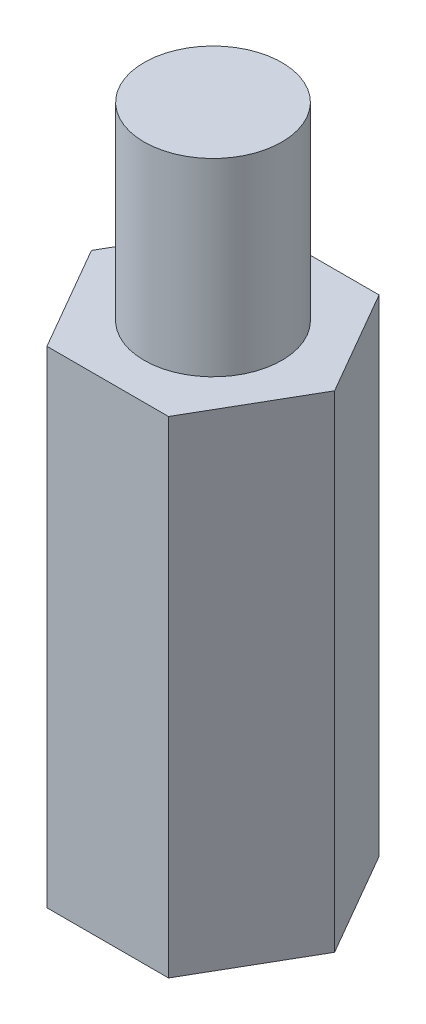
ISO-10303-21;
HEADER;
FILE_DESCRIPTION(('STEP AP214'),'2;1');
FILE_NAME('part.step','',(''),(''),'','','');
FILE_SCHEMA(('AUTOMOTIVE_DESIGN { 1 0 10303 214 1 1 1 1 }'));
ENDSEC;
DATA;
#1=APPLICATION_CONTEXT('core data for automotive mechanical design processes');
#2=APPLICATION_PROTOCOL_DEFINITION('international standard','automotive_design',2000,#1);
#3=PRODUCT_CONTEXT('',#1,'mechanical');
#4=PRODUCT('Part','Part','',(#3));
#5=PRODUCT_RELATED_PRODUCT_CATEGORY('part','',(#4));
#6=PRODUCT_DEFINITION_FORMATION('','',#4);
#7=PRODUCT_DEFINITION_CONTEXT('part definition',#1,'design');
#8=PRODUCT_DEFINITION('design','',#6,#7);
#9=PRODUCT_DEFINITION_SHAPE('','',#8);
#10=(LENGTH_UNIT() NAMED_UNIT(*) SI_UNIT(.MILLI.,.METRE.));
#11=(NAMED_UNIT(*) PLANE_ANGLE_UNIT() SI_UNIT($,.RADIAN.));
#12=(NAMED_UNIT(*) SI_UNIT($,.STERADIAN.) SOLID_ANGLE_UNIT());
#13=UNCERTAINTY_MEASURE_WITH_UNIT(LENGTH_MEASURE(1.E-05),#10,'distance_accuracy_value','');
#14=(GEOMETRIC_REPRESENTATION_CONTEXT(3) GLOBAL_UNCERTAINTY_ASSIGNED_CONTEXT((#13)) GLOBAL_UNIT_ASSIGNED_CONTEXT((#10,
#11,#12)) REPRESENTATION_CONTEXT('',''));
#15=CARTESIAN_POINT('',(0.,0.,0.));
#16=DIRECTION('',(0.,0.,1.));
#17=DIRECTION('',(1.,0.,0.));
#18=AXIS2_PLACEMENT_3D('',#15,#16,#17);
#19=CARTESIAN_POINT('',(0.,18.,0.));
#20=DIRECTION('',(0.,1.,0.));
#21=DIRECTION('',(0.,0.,1.));
#22=AXIS2_PLACEMENT_3D('',#19,#20,#21);
#23=PLANE('',#22);
#24=CARTESIAN_POINT('',(0.,18.,0.));
#25=DIRECTION('',(0.,1.,0.));
#26=DIRECTION('',(0.,0.,1.));
#27=AXIS2_PLACEMENT_3D('',#24,#25,#26);
#28=CIRCLE('',#27,2.55);
#29=CARTESIAN_POINT('',(0.,18.,2.55));
#30=VERTEX_POINT('',#29);
#31=EDGE_CURVE('E201',#30,#30,#28,.T.);
#32=ORIENTED_EDGE('',*,*,#31,.F.);
#33=EDGE_LOOP('',(#32));
#34=FACE_BOUND('',#33,.T.);
#35=DIRECTION('',(0.5,0.,-0.866025403784439));
#36=VECTOR('',#35,1.);
#37=CARTESIAN_POINT('',(2.25,18.,3.89711431702997));
#38=LINE('',#37,#36);
#39=CARTESIAN_POINT('',(2.25,18.,3.89711431702997));
#40=VERTEX_POINT('',#39);
#41=CARTESIAN_POINT('',(4.5,18.,0.));
#42=VERTEX_POINT('',#41);
#43=EDGE_CURVE('E145',#40,#42,#38,.T.);
#44=ORIENTED_EDGE('',*,*,#43,.T.);
#45=DIRECTION('',(-0.5,0.,-0.866025403784439));
#46=VECTOR('',#45,1.);
#47=CARTESIAN_POINT('',(4.5,18.,0.));
#48=LINE('',#47,#46);
#49=CARTESIAN_POINT('',(2.25,18.,-3.89711431702997));
#50=VERTEX_POINT('',#49);
#51=EDGE_CURVE('E94',#42,#50,#48,.T.);
#52=ORIENTED_EDGE('',*,*,#51,.T.);
#53=DIRECTION('',(-1.,0.,0.));
#54=VECTOR('',#53,1.);
#55=CARTESIAN_POINT('',(2.25,18.,-3.89711431702997));
#56=LINE('',#55,#54);
#57=CARTESIAN_POINT('',(-2.25,18.,-3.89711431702997));
#58=VERTEX_POINT('',#57);
#59=EDGE_CURVE('E106',#50,#58,#56,.T.);
#60=ORIENTED_EDGE('',*,*,#59,.T.);
#61=DIRECTION('',(-0.5,0.,0.866025403784439));
#62=VECTOR('',#61,1.);
#63=CARTESIAN_POINT('',(-2.25,18.,-3.89711431702997));
#64=LINE('',#63,#62);
#65=CARTESIAN_POINT('',(-4.5,18.,0.));
#66=VERTEX_POINT('',#65);
#67=EDGE_CURVE('E101',#58,#66,#64,.T.);
#68=ORIENTED_EDGE('',*,*,#67,.T.);
#69=DIRECTION('',(0.5,0.,0.866025403784439));
#70=VECTOR('',#69,1.);
#71=CARTESIAN_POINT('',(-4.5,18.,0.));
#72=LINE('',#71,#70);
#73=CARTESIAN_POINT('',(-2.25,18.,3.89711431702997));
#74=VERTEX_POINT('',#73);
#75=EDGE_CURVE('E104',#66,#74,#72,.T.);
#76=ORIENTED_EDGE('',*,*,#75,.T.);
#77=DIRECTION('',(1.,0.,0.));
#78=VECTOR('',#77,1.);
#79=CARTESIAN_POINT('',(-2.25,18.,3.89711431702997));
#80=LINE('',#79,#78);
#81=EDGE_CURVE('E57',#74,#40,#80,.T.);
#82=ORIENTED_EDGE('',*,*,#81,.T.);
#83=EDGE_LOOP('',(#44,#52,#60,#68,#76,#82));
#84=FACE_BOUND('',#83,.T.);
#85=ADVANCED_FACE('F39',(#34,#84),#23,.T.);
#86=CARTESIAN_POINT('',(0.,0.,0.));
#87=DIRECTION('',(0.,1.,0.));
#88=DIRECTION('',(0.,0.,1.));
#89=AXIS2_PLACEMENT_3D('',#86,#87,#88);
#90=PLANE('',#89);
#91=DIRECTION('',(0.5,0.,-0.866025403784439));
#92=VECTOR('',#91,1.);
#93=CARTESIAN_POINT('',(2.25,0.,3.89711431702997));
#94=LINE('',#93,#92);
#95=CARTESIAN_POINT('',(2.25,0.,3.89711431702997));
#96=VERTEX_POINT('',#95);
#97=CARTESIAN_POINT('',(4.5,0.,0.));
#98=VERTEX_POINT('',#97);
#99=EDGE_CURVE('E128',#96,#98,#94,.T.);
#100=ORIENTED_EDGE('',*,*,#99,.F.);
#101=DIRECTION('',(1.,0.,0.));
#102=VECTOR('',#101,1.);
#103=CARTESIAN_POINT('',(-2.25,0.,3.89711431702997));
#104=LINE('',#103,#102);
#105=CARTESIAN_POINT('',(-2.25,0.,3.89711431702997));
#106=VERTEX_POINT('',#105);
#107=EDGE_CURVE('E86',#106,#96,#104,.T.);
#108=ORIENTED_EDGE('',*,*,#107,.F.);
#109=DIRECTION('',(0.5,0.,0.866025403784439));
#110=VECTOR('',#109,1.);
#111=CARTESIAN_POINT('',(-4.5,0.,0.));
#112=LINE('',#111,#110);
#113=CARTESIAN_POINT('',(-4.5,0.,0.));
#114=VERTEX_POINT('',#113);
#115=EDGE_CURVE('E80',#114,#106,#112,.T.);
#116=ORIENTED_EDGE('',*,*,#115,.F.);
#117=DIRECTION('',(-0.5,0.,0.866025403784439));
#118=VECTOR('',#117,1.);
#119=CARTESIAN_POINT('',(-2.25,0.,-3.89711431702997));
#120=LINE('',#119,#118);
#121=CARTESIAN_POINT('',(-2.25,0.,-3.89711431702997));
#122=VERTEX_POINT('',#121);
#123=EDGE_CURVE('E115',#122,#114,#120,.T.);
#124=ORIENTED_EDGE('',*,*,#123,.F.);
#125=DIRECTION('',(-1.,0.,0.));
#126=VECTOR('',#125,1.);
#127=CARTESIAN_POINT('',(2.25,0.,-3.89711431702997));
#128=LINE('',#127,#126);
#129=CARTESIAN_POINT('',(2.25,0.,-3.89711431702997));
#130=VERTEX_POINT('',#129);
#131=EDGE_CURVE('E136',#130,#122,#128,.T.);
#132=ORIENTED_EDGE('',*,*,#131,.F.);
#133=DIRECTION('',(-0.5,0.,-0.866025403784439));
#134=VECTOR('',#133,1.);
#135=CARTESIAN_POINT('',(4.5,0.,0.));
#136=LINE('',#135,#134);
#137=EDGE_CURVE('E132',#98,#130,#136,.T.);
#138=ORIENTED_EDGE('',*,*,#137,.F.);
#139=EDGE_LOOP('',(#100,#108,#116,#124,#132,#138));
#140=FACE_BOUND('',#139,.T.);
#141=CARTESIAN_POINT('',(0.,0.,0.));
#142=DIRECTION('',(0.,1.,0.));
#143=DIRECTION('',(0.,0.,1.));
#144=AXIS2_PLACEMENT_3D('',#141,#142,#143);
#145=CIRCLE('',#144,2.5);
#146=CARTESIAN_POINT('',(0.,0.,2.5));
#147=VERTEX_POINT('',#146);
#148=EDGE_CURVE('E133',#147,#147,#145,.T.);
#149=ORIENTED_EDGE('',*,*,#148,.T.);
#150=EDGE_LOOP('',(#149));
#151=FACE_BOUND('',#150,.T.);
#152=ADVANCED_FACE('F158',(#140,#151),#90,.F.);
#153=CARTESIAN_POINT('',(2.25,18.,3.89711431702997));
#154=DIRECTION('',(-0.866025403784439,0.,-0.5));
#155=DIRECTION('',(-0.5,0.,0.866025403784439));
#156=AXIS2_PLACEMENT_3D('',#153,#154,#155);
#157=PLANE('',#156);
#158=ORIENTED_EDGE('',*,*,#99,.T.);
#159=DIRECTION('',(0.,-1.,0.));
#160=VECTOR('',#159,1.);
#161=CARTESIAN_POINT('',(4.5,18.,0.));
#162=LINE('',#161,#160);
#163=EDGE_CURVE('E11',#42,#98,#162,.T.);
#164=ORIENTED_EDGE('',*,*,#163,.F.);
#165=ORIENTED_EDGE('',*,*,#43,.F.);
#166=DIRECTION('',(0.,-1.,0.));
#167=VECTOR('',#166,1.);
#168=CARTESIAN_POINT('',(2.25,18.,3.89711431702997));
#169=LINE('',#168,#167);
#170=EDGE_CURVE('E124',#40,#96,#169,.T.);
#171=ORIENTED_EDGE('',*,*,#170,.T.);
#172=EDGE_LOOP('',(#158,#164,#165,#171));
#173=FACE_BOUND('',#172,.T.);
#174=ADVANCED_FACE('F41',(#173),#157,.F.);
#175=CARTESIAN_POINT('',(4.5,18.,0.));
#176=DIRECTION('',(-0.866025403784439,0.,0.5));
#177=DIRECTION('',(0.5,0.,0.866025403784439));
#178=AXIS2_PLACEMENT_3D('',#175,#176,#177);
#179=PLANE('',#178);
#180=ORIENTED_EDGE('',*,*,#137,.T.);
#181=DIRECTION('',(0.,-1.,0.));
#182=VECTOR('',#181,1.);
#183=CARTESIAN_POINT('',(2.25,18.,-3.89711431702997));
#184=LINE('',#183,#182);
#185=EDGE_CURVE('E49',#50,#130,#184,.T.);
#186=ORIENTED_EDGE('',*,*,#185,.F.);
#187=ORIENTED_EDGE('',*,*,#51,.F.);
#188=ORIENTED_EDGE('',*,*,#163,.T.);
#189=EDGE_LOOP('',(#180,#186,#187,#188));
#190=FACE_BOUND('',#189,.T.);
#191=ADVANCED_FACE('F255',(#190),#179,.F.);
#192=CARTESIAN_POINT('',(2.25,18.,-3.89711431702997));
#193=DIRECTION('',(0.,0.,1.));
#194=DIRECTION('',(1.,0.,0.));
#195=AXIS2_PLACEMENT_3D('',#192,#193,#194);
#196=PLANE('',#195);
#197=ORIENTED_EDGE('',*,*,#131,.T.);
#198=DIRECTION('',(0.,-1.,0.));
#199=VECTOR('',#198,1.);
#200=CARTESIAN_POINT('',(-2.25,18.,-3.89711431702997));
#201=LINE('',#200,#199);
#202=EDGE_CURVE('E117',#58,#122,#201,.T.);
#203=ORIENTED_EDGE('',*,*,#202,.F.);
#204=ORIENTED_EDGE('',*,*,#59,.F.);
#205=ORIENTED_EDGE('',*,*,#185,.T.);
#206=EDGE_LOOP('',(#197,#203,#204,#205));
#207=FACE_BOUND('',#206,.T.);
#208=ADVANCED_FACE('F155',(#207),#196,.F.);
#209=CARTESIAN_POINT('',(-2.25,18.,-3.89711431702997));
#210=DIRECTION('',(0.866025403784439,0.,0.5));
#211=DIRECTION('',(0.5,0.,-0.866025403784439));
#212=AXIS2_PLACEMENT_3D('',#209,#210,#211);
#213=PLANE('',#212);
#214=ORIENTED_EDGE('',*,*,#123,.T.);
#215=DIRECTION('',(0.,-1.,0.));
#216=VECTOR('',#215,1.);
#217=CARTESIAN_POINT('',(-4.5,18.,0.));
#218=LINE('',#217,#216);
#219=EDGE_CURVE('E112',#66,#114,#218,.T.);
#220=ORIENTED_EDGE('',*,*,#219,.F.);
#221=ORIENTED_EDGE('',*,*,#67,.F.);
#222=ORIENTED_EDGE('',*,*,#202,.T.);
#223=EDGE_LOOP('',(#214,#220,#221,#222));
#224=FACE_BOUND('',#223,.T.);
#225=ADVANCED_FACE('F113',(#224),#213,.F.);
#226=CARTESIAN_POINT('',(-4.5,18.,0.));
#227=DIRECTION('',(0.866025403784439,0.,-0.5));
#228=DIRECTION('',(-0.5,0.,-0.866025403784439));
#229=AXIS2_PLACEMENT_3D('',#226,#227,#228);
#230=PLANE('',#229);
#231=ORIENTED_EDGE('',*,*,#115,.T.);
#232=DIRECTION('',(0.,-1.,0.));
#233=VECTOR('',#232,1.);
#234=CARTESIAN_POINT('',(-2.25,18.,3.89711431702997));
#235=LINE('',#234,#233);
#236=EDGE_CURVE('E118',#74,#106,#235,.T.);
#237=ORIENTED_EDGE('',*,*,#236,.F.);
#238=ORIENTED_EDGE('',*,*,#75,.F.);
#239=ORIENTED_EDGE('',*,*,#219,.T.);
#240=EDGE_LOOP('',(#231,#237,#238,#239));
#241=FACE_BOUND('',#240,.T.);
#242=ADVANCED_FACE('F120',(#241),#230,.F.);
#243=CARTESIAN_POINT('',(-2.25,18.,3.89711431702997));
#244=DIRECTION('',(0.,0.,-1.));
#245=DIRECTION('',(-1.,0.,0.));
#246=AXIS2_PLACEMENT_3D('',#243,#244,#245);
#247=PLANE('',#246);
#248=ORIENTED_EDGE('',*,*,#107,.T.);
#249=ORIENTED_EDGE('',*,*,#170,.F.);
#250=ORIENTED_EDGE('',*,*,#81,.F.);
#251=ORIENTED_EDGE('',*,*,#236,.T.);
#252=EDGE_LOOP('',(#248,#249,#250,#251));
#253=FACE_BOUND('',#252,.T.);
#254=ADVANCED_FACE('F163',(#253),#247,.F.);
#255=CARTESIAN_POINT('',(0.,18.,0.));
#256=DIRECTION('',(0.,-1.,0.));
#257=DIRECTION('',(0.,0.,-1.));
#258=AXIS2_PLACEMENT_3D('',#255,#256,#257);
#259=CYLINDRICAL_SURFACE('',#258,2.5);
#260=CARTESIAN_POINT('',(0.,18.,0.));
#261=DIRECTION('',(0.,1.,0.));
#262=DIRECTION('',(0.,0.,1.));
#263=AXIS2_PLACEMENT_3D('',#260,#261,#262);
#264=CIRCLE('',#263,2.5);
#265=CARTESIAN_POINT('',(0.,18.,2.5));
#266=VERTEX_POINT('',#265);
#267=EDGE_CURVE('E200',#266,#266,#264,.T.);
#268=ORIENTED_EDGE('',*,*,#267,.T.);
#269=EDGE_LOOP('',(#268));
#270=FACE_BOUND('',#269,.T.);
#271=ORIENTED_EDGE('',*,*,#148,.F.);
#272=EDGE_LOOP('',(#271));
#273=FACE_BOUND('',#272,.T.);
#274=ADVANCED_FACE('F165',(#270,#273),#259,.F.);
#275=CARTESIAN_POINT('',(0.,18.,0.));
#276=DIRECTION('',(0.,1.,0.));
#277=DIRECTION('',(0.,0.,1.));
#278=AXIS2_PLACEMENT_3D('',#275,#276,#277);
#279=PLANE('',#278);
#280=ORIENTED_EDGE('',*,*,#267,.F.);
#281=EDGE_LOOP('',(#280));
#282=FACE_BOUND('',#281,.T.);
#283=ADVANCED_FACE('F171',(#282),#279,.F.);
#284=CARTESIAN_POINT('',(0.,25.,0.));
#285=DIRECTION('',(0.,-1.,0.));
#286=DIRECTION('',(0.,0.,-1.));
#287=AXIS2_PLACEMENT_3D('',#284,#285,#286);
#288=CYLINDRICAL_SURFACE('',#287,2.55);
#289=CARTESIAN_POINT('',(0.,25.,0.));
#290=DIRECTION('',(0.,1.,0.));
#291=DIRECTION('',(0.,0.,1.));
#292=AXIS2_PLACEMENT_3D('',#289,#290,#291);
#293=CIRCLE('',#292,2.55);
#294=CARTESIAN_POINT('',(0.,25.,2.55));
#295=VERTEX_POINT('',#294);
#296=EDGE_CURVE('E198',#295,#295,#293,.T.);
#297=ORIENTED_EDGE('',*,*,#296,.F.);
#298=EDGE_LOOP('',(#297));
#299=FACE_BOUND('',#298,.T.);
#300=ORIENTED_EDGE('',*,*,#31,.T.);
#301=EDGE_LOOP('',(#300));
#302=FACE_BOUND('',#301,.T.);
#303=ADVANCED_FACE('F184',(#299,#302),#288,.T.);
#304=CARTESIAN_POINT('',(0.,25.,0.));
#305=DIRECTION('',(0.,1.,0.));
#306=DIRECTION('',(0.,0.,1.));
#307=AXIS2_PLACEMENT_3D('',#304,#305,#306);
#308=PLANE('',#307);
#309=ORIENTED_EDGE('',*,*,#296,.T.);
#310=EDGE_LOOP('',(#309));
#311=FACE_BOUND('',#310,.T.);
#312=ADVANCED_FACE('F187',(#311),#308,.T.);
#313=CLOSED_SHELL('',(#85,#152,#174,#191,#208,#225,#242,#254,#274,#283,#303,#312));
#314=MANIFOLD_SOLID_BREP('B2',#313);
#315=ADVANCED_BREP_SHAPE_REPRESENTATION('',(#18,#314),#14);
#316=SHAPE_DEFINITION_REPRESENTATION(#9,#315);
ENDSEC;
END-ISO-10303-21;
